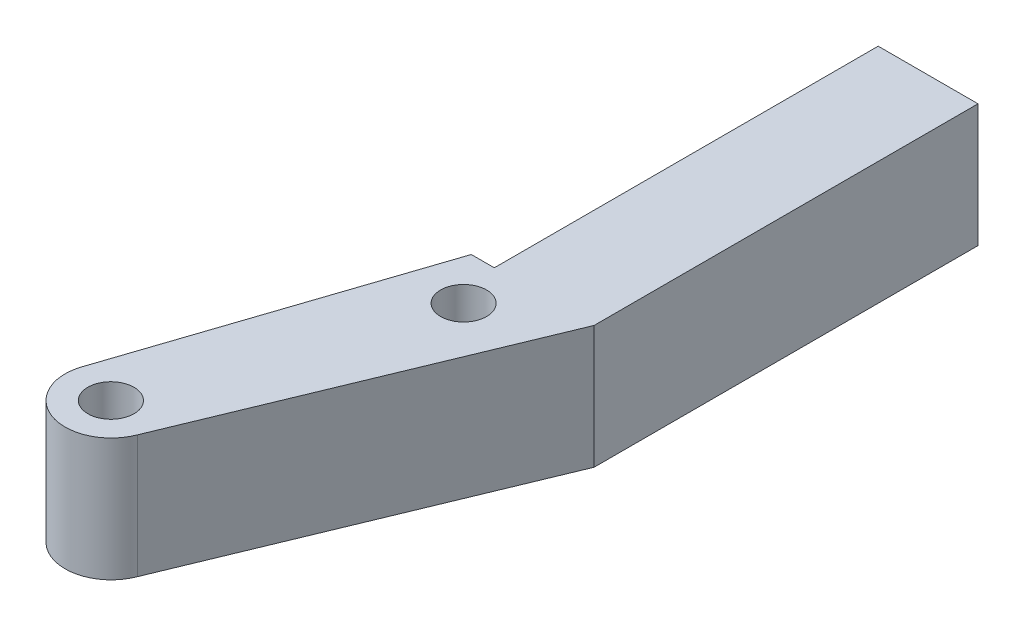
ISO-10303-21;
HEADER;
FILE_DESCRIPTION(('STEP AP214'),'2;1');
FILE_NAME('part.step','',(''),(''),'','','');
FILE_SCHEMA(('AUTOMOTIVE_DESIGN { 1 0 10303 214 1 1 1 1 }'));
ENDSEC;
DATA;
#1=APPLICATION_CONTEXT('core data for automotive mechanical design processes');
#2=APPLICATION_PROTOCOL_DEFINITION('international standard','automotive_design',2000,#1);
#3=PRODUCT_CONTEXT('',#1,'mechanical');
#4=PRODUCT('Part','Part','',(#3));
#5=PRODUCT_RELATED_PRODUCT_CATEGORY('part','',(#4));
#6=PRODUCT_DEFINITION_FORMATION('','',#4);
#7=PRODUCT_DEFINITION_CONTEXT('part definition',#1,'design');
#8=PRODUCT_DEFINITION('design','',#6,#7);
#9=PRODUCT_DEFINITION_SHAPE('','',#8);
#10=(LENGTH_UNIT() NAMED_UNIT(*) SI_UNIT(.MILLI.,.METRE.));
#11=(NAMED_UNIT(*) PLANE_ANGLE_UNIT() SI_UNIT($,.RADIAN.));
#12=(NAMED_UNIT(*) SI_UNIT($,.STERADIAN.) SOLID_ANGLE_UNIT());
#13=UNCERTAINTY_MEASURE_WITH_UNIT(LENGTH_MEASURE(1.E-05),#10,'distance_accuracy_value','');
#14=(GEOMETRIC_REPRESENTATION_CONTEXT(3) GLOBAL_UNCERTAINTY_ASSIGNED_CONTEXT((#13)) GLOBAL_UNIT_ASSIGNED_CONTEXT((#10,
#11,#12)) REPRESENTATION_CONTEXT('',''));
#15=CARTESIAN_POINT('',(0.,0.,0.));
#16=DIRECTION('',(0.,0.,1.));
#17=DIRECTION('',(1.,0.,0.));
#18=AXIS2_PLACEMENT_3D('',#15,#16,#17);
#19=CARTESIAN_POINT('',(-4.0002358704144,8.,20.6078251688276));
#20=DIRECTION('',(0.,1.,0.));
#21=DIRECTION('',(0.,0.,1.));
#22=AXIS2_PLACEMENT_3D('',#19,#20,#21);
#23=PLANE('',#22);
#24=CARTESIAN_POINT('',(1.99608437057648,8.,3.64859779585808));
#25=DIRECTION('',(0.,1.,0.));
#26=DIRECTION('',(0.,0.,1.));
#27=AXIS2_PLACEMENT_3D('',#24,#25,#26);
#28=CIRCLE('',#27,1.50000019982247);
#29=CARTESIAN_POINT('',(1.99608437057648,8.,5.14859799568055));
#30=VERTEX_POINT('',#29);
#31=EDGE_CURVE('E128',#30,#30,#28,.T.);
#32=ORIENTED_EDGE('',*,*,#31,.F.);
#33=EDGE_LOOP('',(#32));
#34=FACE_BOUND('',#33,.T.);
#35=CARTESIAN_POINT('',(-4.0002358704144,8.,20.6078251688276));
#36=DIRECTION('',(0.,1.,0.));
#37=DIRECTION('',(0.,0.,1.));
#38=AXIS2_PLACEMENT_3D('',#35,#36,#37);
#39=CIRCLE('',#38,3.00038629686491);
#40=CARTESIAN_POINT('',(-6.87242912352297,8.,19.7401709478315));
#41=VERTEX_POINT('',#40);
#42=CARTESIAN_POINT('',(-1.19757038951097,8.,21.6789853494575));
#43=VERTEX_POINT('',#42);
#44=EDGE_CURVE('E137',#41,#43,#39,.T.);
#45=ORIENTED_EDGE('',*,*,#44,.T.);
#46=DIRECTION('',(0.382030014465538,0.,-0.924149916435348));
#47=VECTOR('',#46,1.);
#48=CARTESIAN_POINT('',(-1.19757038951097,8.,21.6789853494575));
#49=LINE('',#48,#47);
#50=CARTESIAN_POINT('',(7.49608414769004,8.,0.648595563691491));
#51=VERTEX_POINT('',#50);
#52=EDGE_CURVE('E90',#43,#51,#49,.T.);
#53=ORIENTED_EDGE('',*,*,#52,.T.);
#54=DIRECTION('',(0.,0.,-1.));
#55=VECTOR('',#54,1.);
#56=CARTESIAN_POINT('',(7.49608414769004,8.,0.648595563691491));
#57=LINE('',#56,#55);
#58=CARTESIAN_POINT('',(7.49608414769004,8.,-24.3514044363085));
#59=VERTEX_POINT('',#58);
#60=EDGE_CURVE('E149',#51,#59,#57,.T.);
#61=ORIENTED_EDGE('',*,*,#60,.T.);
#62=DIRECTION('',(-1.,0.,0.));
#63=VECTOR('',#62,1.);
#64=CARTESIAN_POINT('',(7.49608414769004,8.,-24.3514044363085));
#65=LINE('',#64,#63);
#66=CARTESIAN_POINT('',(0.996084147690035,8.,-24.3514044363085));
#67=VERTEX_POINT('',#66);
#68=EDGE_CURVE('E106',#59,#67,#65,.T.);
#69=ORIENTED_EDGE('',*,*,#68,.T.);
#70=DIRECTION('',(0.,0.,1.));
#71=VECTOR('',#70,1.);
#72=CARTESIAN_POINT('',(0.996084147690035,8.,-24.3514044363085));
#73=LINE('',#72,#71);
#74=CARTESIAN_POINT('',(0.996084147690035,8.,0.648595563691491));
#75=VERTEX_POINT('',#74);
#76=EDGE_CURVE('E100',#67,#75,#73,.T.);
#77=ORIENTED_EDGE('',*,*,#76,.T.);
#78=DIRECTION('',(-1.,0.,0.));
#79=VECTOR('',#78,1.);
#80=CARTESIAN_POINT('',(0.996084147690035,8.,0.648595563691491));
#81=LINE('',#80,#79);
#82=CARTESIAN_POINT('',(-0.503915852309965,8.,0.648595563691491));
#83=VERTEX_POINT('',#82);
#84=EDGE_CURVE('E104',#75,#83,#81,.T.);
#85=ORIENTED_EDGE('',*,*,#84,.T.);
#86=DIRECTION('',(-0.31643591595337,0.,0.948613889364241));
#87=VECTOR('',#86,1.);
#88=CARTESIAN_POINT('',(-0.503915852309965,8.,0.648595563691491));
#89=LINE('',#88,#87);
#90=EDGE_CURVE('E50',#83,#41,#89,.T.);
#91=ORIENTED_EDGE('',*,*,#90,.T.);
#92=EDGE_LOOP('',(#45,#53,#61,#69,#77,#85,#91));
#93=FACE_BOUND('',#92,.T.);
#94=CARTESIAN_POINT('',(-4.00391602694264,8.,20.6185969036035));
#95=DIRECTION('',(0.,1.,0.));
#96=DIRECTION('',(0.,0.,1.));
#97=AXIS2_PLACEMENT_3D('',#94,#95,#96);
#98=CIRCLE('',#97,1.49999991018576);
#99=CARTESIAN_POINT('',(-4.00391602694264,8.,22.1185968137892));
#100=VERTEX_POINT('',#99);
#101=EDGE_CURVE('E164',#100,#100,#98,.T.);
#102=ORIENTED_EDGE('',*,*,#101,.F.);
#103=EDGE_LOOP('',(#102));
#104=FACE_BOUND('',#103,.T.);
#105=ADVANCED_FACE('F33',(#34,#93,#104),#23,.T.);
#106=CARTESIAN_POINT('',(-4.0002358704144,0.,20.6078251688276));
#107=DIRECTION('',(0.,1.,0.));
#108=DIRECTION('',(0.,0.,1.));
#109=AXIS2_PLACEMENT_3D('',#106,#107,#108);
#110=PLANE('',#109);
#111=CARTESIAN_POINT('',(-4.0002358704144,0.,20.6078251688276));
#112=DIRECTION('',(0.,1.,0.));
#113=DIRECTION('',(0.,0.,1.));
#114=AXIS2_PLACEMENT_3D('',#111,#112,#113);
#115=CIRCLE('',#114,3.00038629686491);
#116=CARTESIAN_POINT('',(-6.87242912352297,0.,19.7401709478315));
#117=VERTEX_POINT('',#116);
#118=CARTESIAN_POINT('',(-1.19757038951097,0.,21.6789853494575));
#119=VERTEX_POINT('',#118);
#120=EDGE_CURVE('E124',#117,#119,#115,.T.);
#121=ORIENTED_EDGE('',*,*,#120,.F.);
#122=DIRECTION('',(-0.31643591595337,0.,0.948613889364241));
#123=VECTOR('',#122,1.);
#124=CARTESIAN_POINT('',(-0.503915852309965,0.,0.648595563691491));
#125=LINE('',#124,#123);
#126=CARTESIAN_POINT('',(-0.503915852309965,0.,0.648595563691491));
#127=VERTEX_POINT('',#126);
#128=EDGE_CURVE('E82',#127,#117,#125,.T.);
#129=ORIENTED_EDGE('',*,*,#128,.F.);
#130=DIRECTION('',(-1.,0.,0.));
#131=VECTOR('',#130,1.);
#132=CARTESIAN_POINT('',(0.996084147690035,0.,0.648595563691491));
#133=LINE('',#132,#131);
#134=CARTESIAN_POINT('',(0.996084147690035,0.,0.648595563691491));
#135=VERTEX_POINT('',#134);
#136=EDGE_CURVE('E76',#135,#127,#133,.T.);
#137=ORIENTED_EDGE('',*,*,#136,.F.);
#138=DIRECTION('',(0.,0.,1.));
#139=VECTOR('',#138,1.);
#140=CARTESIAN_POINT('',(0.996084147690035,0.,-24.3514044363085));
#141=LINE('',#140,#139);
#142=CARTESIAN_POINT('',(0.996084147690035,0.,-24.3514044363085));
#143=VERTEX_POINT('',#142);
#144=EDGE_CURVE('E114',#143,#135,#141,.T.);
#145=ORIENTED_EDGE('',*,*,#144,.F.);
#146=DIRECTION('',(-1.,0.,0.));
#147=VECTOR('',#146,1.);
#148=CARTESIAN_POINT('',(7.49608414769004,0.,-24.3514044363085));
#149=LINE('',#148,#147);
#150=CARTESIAN_POINT('',(7.49608414769004,0.,-24.3514044363085));
#151=VERTEX_POINT('',#150);
#152=EDGE_CURVE('E132',#151,#143,#149,.T.);
#153=ORIENTED_EDGE('',*,*,#152,.F.);
#154=DIRECTION('',(0.,0.,-1.));
#155=VECTOR('',#154,1.);
#156=CARTESIAN_POINT('',(7.49608414769004,0.,0.648595563691491));
#157=LINE('',#156,#155);
#158=CARTESIAN_POINT('',(7.49608414769004,0.,0.648595563691491));
#159=VERTEX_POINT('',#158);
#160=EDGE_CURVE('E130',#159,#151,#157,.T.);
#161=ORIENTED_EDGE('',*,*,#160,.F.);
#162=DIRECTION('',(0.382030014465538,0.,-0.924149916435348));
#163=VECTOR('',#162,1.);
#164=CARTESIAN_POINT('',(-1.19757038951097,0.,21.6789853494575));
#165=LINE('',#164,#163);
#166=EDGE_CURVE('E127',#119,#159,#165,.T.);
#167=ORIENTED_EDGE('',*,*,#166,.F.);
#168=EDGE_LOOP('',(#121,#129,#137,#145,#153,#161,#167));
#169=FACE_BOUND('',#168,.T.);
#170=CARTESIAN_POINT('',(1.99608437057648,0.,3.64859779585808));
#171=DIRECTION('',(0.,1.,0.));
#172=DIRECTION('',(0.,0.,1.));
#173=AXIS2_PLACEMENT_3D('',#170,#171,#172);
#174=CIRCLE('',#173,1.50000019982247);
#175=CARTESIAN_POINT('',(1.99608437057648,0.,5.14859799568055));
#176=VERTEX_POINT('',#175);
#177=EDGE_CURVE('E161',#176,#176,#174,.T.);
#178=ORIENTED_EDGE('',*,*,#177,.T.);
#179=EDGE_LOOP('',(#178));
#180=FACE_BOUND('',#179,.T.);
#181=CARTESIAN_POINT('',(-4.00391602694264,0.,20.6185969036035));
#182=DIRECTION('',(0.,1.,0.));
#183=DIRECTION('',(0.,0.,1.));
#184=AXIS2_PLACEMENT_3D('',#181,#182,#183);
#185=CIRCLE('',#184,1.49999991018576);
#186=CARTESIAN_POINT('',(-4.00391602694264,0.,22.1185968137892));
#187=VERTEX_POINT('',#186);
#188=EDGE_CURVE('E167',#187,#187,#185,.T.);
#189=ORIENTED_EDGE('',*,*,#188,.T.);
#190=EDGE_LOOP('',(#189));
#191=FACE_BOUND('',#190,.T.);
#192=ADVANCED_FACE('F153',(#169,#180,#191),#110,.F.);
#193=CARTESIAN_POINT('',(-4.0002358704144,8.,20.6078251688276));
#194=DIRECTION('',(0.,-1.,0.));
#195=DIRECTION('',(0.,0.,-1.));
#196=AXIS2_PLACEMENT_3D('',#193,#194,#195);
#197=CYLINDRICAL_SURFACE('',#196,3.00038629686491);
#198=ORIENTED_EDGE('',*,*,#120,.T.);
#199=DIRECTION('',(0.,-1.,0.));
#200=VECTOR('',#199,1.);
#201=CARTESIAN_POINT('',(-1.19757038951097,8.,21.6789853494575));
#202=LINE('',#201,#200);
#203=EDGE_CURVE('E11',#43,#119,#202,.T.);
#204=ORIENTED_EDGE('',*,*,#203,.F.);
#205=ORIENTED_EDGE('',*,*,#44,.F.);
#206=DIRECTION('',(0.,-1.,0.));
#207=VECTOR('',#206,1.);
#208=CARTESIAN_POINT('',(-6.87242912352297,8.,19.7401709478315));
#209=LINE('',#208,#207);
#210=EDGE_CURVE('E120',#41,#117,#209,.T.);
#211=ORIENTED_EDGE('',*,*,#210,.T.);
#212=EDGE_LOOP('',(#198,#204,#205,#211));
#213=FACE_BOUND('',#212,.T.);
#214=ADVANCED_FACE('F35',(#213),#197,.T.);
#215=CARTESIAN_POINT('',(-1.19757038951097,8.,21.6789853494575));
#216=DIRECTION('',(-0.924149916435348,0.,-0.382030014465538));
#217=DIRECTION('',(-0.382030014465538,0.,0.924149916435348));
#218=AXIS2_PLACEMENT_3D('',#215,#216,#217);
#219=PLANE('',#218);
#220=ORIENTED_EDGE('',*,*,#166,.T.);
#221=DIRECTION('',(0.,-1.,0.));
#222=VECTOR('',#221,1.);
#223=CARTESIAN_POINT('',(7.49608414769004,8.,0.648595563691491));
#224=LINE('',#223,#222);
#225=EDGE_CURVE('E42',#51,#159,#224,.T.);
#226=ORIENTED_EDGE('',*,*,#225,.F.);
#227=ORIENTED_EDGE('',*,*,#52,.F.);
#228=ORIENTED_EDGE('',*,*,#203,.T.);
#229=EDGE_LOOP('',(#220,#226,#227,#228));
#230=FACE_BOUND('',#229,.T.);
#231=ADVANCED_FACE('F197',(#230),#219,.F.);
#232=CARTESIAN_POINT('',(7.49608414769004,8.,0.648595563691491));
#233=DIRECTION('',(-1.,0.,0.));
#234=DIRECTION('',(0.,0.,1.));
#235=AXIS2_PLACEMENT_3D('',#232,#233,#234);
#236=PLANE('',#235);
#237=ORIENTED_EDGE('',*,*,#160,.T.);
#238=DIRECTION('',(0.,-1.,0.));
#239=VECTOR('',#238,1.);
#240=CARTESIAN_POINT('',(7.49608414769004,8.,-24.3514044363085));
#241=LINE('',#240,#239);
#242=EDGE_CURVE('E141',#59,#151,#241,.T.);
#243=ORIENTED_EDGE('',*,*,#242,.F.);
#244=ORIENTED_EDGE('',*,*,#60,.F.);
#245=ORIENTED_EDGE('',*,*,#225,.T.);
#246=EDGE_LOOP('',(#237,#243,#244,#245));
#247=FACE_BOUND('',#246,.T.);
#248=ADVANCED_FACE('F147',(#247),#236,.F.);
#249=CARTESIAN_POINT('',(7.49608414769004,8.,-24.3514044363085));
#250=DIRECTION('',(0.,0.,1.));
#251=DIRECTION('',(1.,0.,0.));
#252=AXIS2_PLACEMENT_3D('',#249,#250,#251);
#253=PLANE('',#252);
#254=ORIENTED_EDGE('',*,*,#152,.T.);
#255=DIRECTION('',(0.,-1.,0.));
#256=VECTOR('',#255,1.);
#257=CARTESIAN_POINT('',(0.996084147690035,8.,-24.3514044363085));
#258=LINE('',#257,#256);
#259=EDGE_CURVE('E115',#67,#143,#258,.T.);
#260=ORIENTED_EDGE('',*,*,#259,.F.);
#261=ORIENTED_EDGE('',*,*,#68,.F.);
#262=ORIENTED_EDGE('',*,*,#242,.T.);
#263=EDGE_LOOP('',(#254,#260,#261,#262));
#264=FACE_BOUND('',#263,.T.);
#265=ADVANCED_FACE('F156',(#264),#253,.F.);
#266=CARTESIAN_POINT('',(0.996084147690035,8.,-24.3514044363085));
#267=DIRECTION('',(1.,0.,0.));
#268=DIRECTION('',(0.,0.,-1.));
#269=AXIS2_PLACEMENT_3D('',#266,#267,#268);
#270=PLANE('',#269);
#271=ORIENTED_EDGE('',*,*,#144,.T.);
#272=DIRECTION('',(0.,-1.,0.));
#273=VECTOR('',#272,1.);
#274=CARTESIAN_POINT('',(0.996084147690035,8.,0.648595563691491));
#275=LINE('',#274,#273);
#276=EDGE_CURVE('E111',#75,#135,#275,.T.);
#277=ORIENTED_EDGE('',*,*,#276,.F.);
#278=ORIENTED_EDGE('',*,*,#76,.F.);
#279=ORIENTED_EDGE('',*,*,#259,.T.);
#280=EDGE_LOOP('',(#271,#277,#278,#279));
#281=FACE_BOUND('',#280,.T.);
#282=ADVANCED_FACE('F112',(#281),#270,.F.);
#283=CARTESIAN_POINT('',(0.996084147690035,8.,0.648595563691491));
#284=DIRECTION('',(0.,0.,1.));
#285=DIRECTION('',(1.,0.,0.));
#286=AXIS2_PLACEMENT_3D('',#283,#284,#285);
#287=PLANE('',#286);
#288=ORIENTED_EDGE('',*,*,#136,.T.);
#289=DIRECTION('',(0.,-1.,0.));
#290=VECTOR('',#289,1.);
#291=CARTESIAN_POINT('',(-0.503915852309965,8.,0.648595563691491));
#292=LINE('',#291,#290);
#293=EDGE_CURVE('E116',#83,#127,#292,.T.);
#294=ORIENTED_EDGE('',*,*,#293,.F.);
#295=ORIENTED_EDGE('',*,*,#84,.F.);
#296=ORIENTED_EDGE('',*,*,#276,.T.);
#297=EDGE_LOOP('',(#288,#294,#295,#296));
#298=FACE_BOUND('',#297,.T.);
#299=ADVANCED_FACE('F118',(#298),#287,.F.);
#300=CARTESIAN_POINT('',(-0.503915852309965,8.,0.648595563691491));
#301=DIRECTION('',(0.948613889364241,0.,0.31643591595337));
#302=DIRECTION('',(0.31643591595337,0.,-0.948613889364241));
#303=AXIS2_PLACEMENT_3D('',#300,#301,#302);
#304=PLANE('',#303);
#305=ORIENTED_EDGE('',*,*,#128,.T.);
#306=ORIENTED_EDGE('',*,*,#210,.F.);
#307=ORIENTED_EDGE('',*,*,#90,.F.);
#308=ORIENTED_EDGE('',*,*,#293,.T.);
#309=EDGE_LOOP('',(#305,#306,#307,#308));
#310=FACE_BOUND('',#309,.T.);
#311=ADVANCED_FACE('F187',(#310),#304,.F.);
#312=CARTESIAN_POINT('',(1.99608437057648,8.,3.64859779585808));
#313=DIRECTION('',(0.,-1.,0.));
#314=DIRECTION('',(0.,0.,-1.));
#315=AXIS2_PLACEMENT_3D('',#312,#313,#314);
#316=CYLINDRICAL_SURFACE('',#315,1.50000019982247);
#317=ORIENTED_EDGE('',*,*,#31,.T.);
#318=EDGE_LOOP('',(#317));
#319=FACE_BOUND('',#318,.T.);
#320=ORIENTED_EDGE('',*,*,#177,.F.);
#321=EDGE_LOOP('',(#320));
#322=FACE_BOUND('',#321,.T.);
#323=ADVANCED_FACE('F184',(#319,#322),#316,.F.);
#324=CARTESIAN_POINT('',(-4.00391602694264,8.,20.6185969036035));
#325=DIRECTION('',(0.,-1.,0.));
#326=DIRECTION('',(0.,0.,-1.));
#327=AXIS2_PLACEMENT_3D('',#324,#325,#326);
#328=CYLINDRICAL_SURFACE('',#327,1.49999991018576);
#329=ORIENTED_EDGE('',*,*,#101,.T.);
#330=EDGE_LOOP('',(#329));
#331=FACE_BOUND('',#330,.T.);
#332=ORIENTED_EDGE('',*,*,#188,.F.);
#333=EDGE_LOOP('',(#332));
#334=FACE_BOUND('',#333,.T.);
#335=ADVANCED_FACE('F173',(#331,#334),#328,.F.);
#336=CLOSED_SHELL('',(#105,#192,#214,#231,#248,#265,#282,#299,#311,#323,#335));
#337=MANIFOLD_SOLID_BREP('B2',#336);
#338=ADVANCED_BREP_SHAPE_REPRESENTATION('',(#18,#337),#14);
#339=SHAPE_DEFINITION_REPRESENTATION(#9,#338);
ENDSEC;
END-ISO-10303-21;
